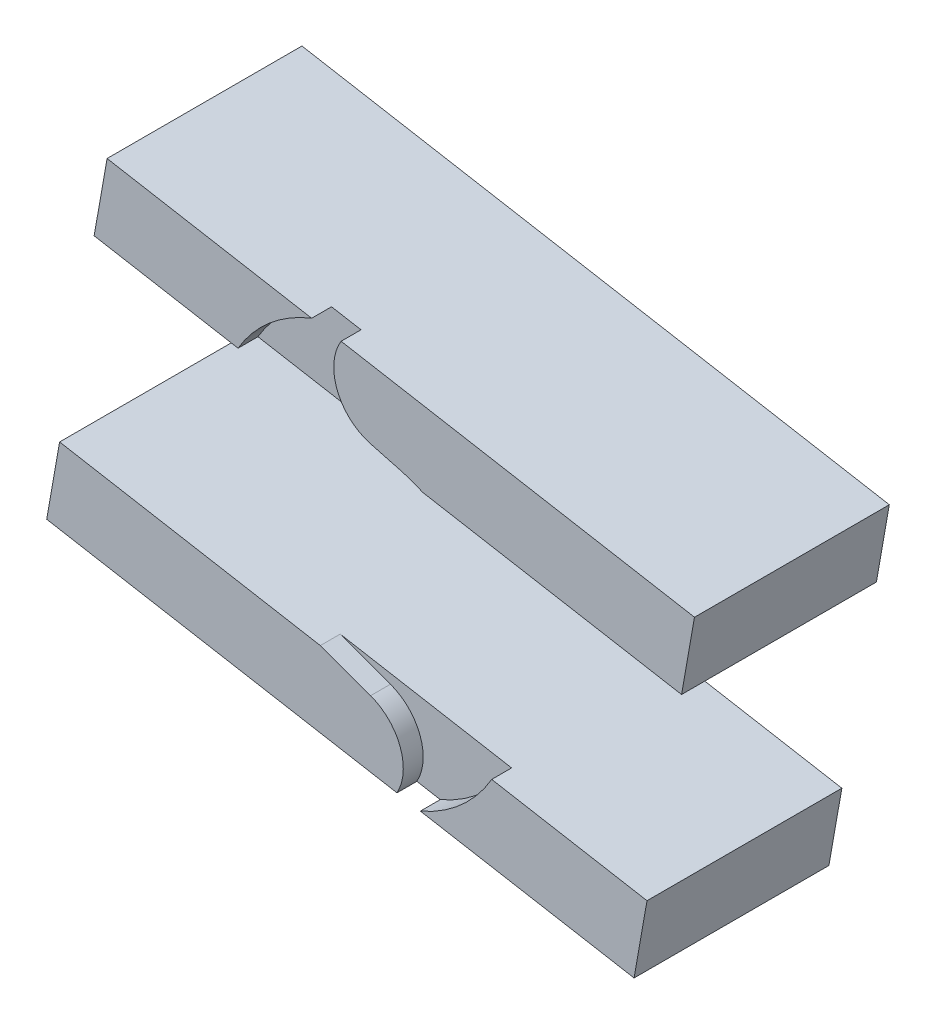
ISO-10303-21;
HEADER;
FILE_DESCRIPTION(('STEP AP214'),'2;1');
FILE_NAME('part.step','',(''),(''),'','','');
FILE_SCHEMA(('AUTOMOTIVE_DESIGN { 1 0 10303 214 1 1 1 1 }'));
ENDSEC;
DATA;
#1=APPLICATION_CONTEXT('core data for automotive mechanical design processes');
#2=APPLICATION_PROTOCOL_DEFINITION('international standard','automotive_design',2000,#1);
#3=PRODUCT_CONTEXT('',#1,'mechanical');
#4=PRODUCT('Part','Part','',(#3));
#5=PRODUCT_RELATED_PRODUCT_CATEGORY('part','',(#4));
#6=PRODUCT_DEFINITION_FORMATION('','',#4);
#7=PRODUCT_DEFINITION_CONTEXT('part definition',#1,'design');
#8=PRODUCT_DEFINITION('design','',#6,#7);
#9=PRODUCT_DEFINITION_SHAPE('','',#8);
#10=(LENGTH_UNIT() NAMED_UNIT(*) SI_UNIT(.MILLI.,.METRE.));
#11=(NAMED_UNIT(*) PLANE_ANGLE_UNIT() SI_UNIT($,.RADIAN.));
#12=(NAMED_UNIT(*) SI_UNIT($,.STERADIAN.) SOLID_ANGLE_UNIT());
#13=UNCERTAINTY_MEASURE_WITH_UNIT(LENGTH_MEASURE(1.E-05),#10,'distance_accuracy_value','');
#14=(GEOMETRIC_REPRESENTATION_CONTEXT(3) GLOBAL_UNCERTAINTY_ASSIGNED_CONTEXT((#13)) GLOBAL_UNIT_ASSIGNED_CONTEXT((#10,
#11,#12)) REPRESENTATION_CONTEXT('',''));
#15=CARTESIAN_POINT('',(0.,0.,0.));
#16=DIRECTION('',(0.,0.,1.));
#17=DIRECTION('',(1.,0.,0.));
#18=AXIS2_PLACEMENT_3D('',#15,#16,#17);
#19=CARTESIAN_POINT('',(-4.34365582023604,-40.135903716019,3.048));
#20=DIRECTION('',(0.,0.,-1.));
#21=DIRECTION('',(-1.,0.,0.));
#22=AXIS2_PLACEMENT_3D('',#19,#20,#21);
#23=CYLINDRICAL_SURFACE('',#22,12.7);
#24=CARTESIAN_POINT('',(-4.34365582023604,-40.135903716019,-3.048));
#25=DIRECTION('',(0.,0.,1.));
#26=DIRECTION('',(1.,0.,0.));
#27=AXIS2_PLACEMENT_3D('',#24,#25,#26);
#28=CIRCLE('',#27,12.7);
#29=CARTESIAN_POINT('',(6.74608058450968,-46.325228919404,-3.048));
#30=VERTEX_POINT('',#29);
#31=CARTESIAN_POINT('',(0.,-28.2018074320379,-3.048));
#32=VERTEX_POINT('',#31);
#33=EDGE_CURVE('E137',#30,#32,#28,.T.);
#34=ORIENTED_EDGE('',*,*,#33,.T.);
#35=DIRECTION('',(0.,0.,-1.));
#36=VECTOR('',#35,1.);
#37=CARTESIAN_POINT('',(0.,-28.2018074320379,3.048));
#38=LINE('',#37,#36);
#39=CARTESIAN_POINT('',(0.,-28.2018074320379,2.032));
#40=VERTEX_POINT('',#39);
#41=EDGE_CURVE('E123',#40,#32,#38,.T.);
#42=ORIENTED_EDGE('',*,*,#41,.F.);
#43=CARTESIAN_POINT('',(-4.34365582023604,-40.135903716019,2.032));
#44=DIRECTION('',(0.,0.,1.));
#45=DIRECTION('',(1.,0.,0.));
#46=AXIS2_PLACEMENT_3D('',#43,#44,#45);
#47=CIRCLE('',#46,12.7);
#48=CARTESIAN_POINT('',(6.74608058450968,-46.325228919404,2.032));
#49=VERTEX_POINT('',#48);
#50=EDGE_CURVE('E133',#40,#49,#47,.F.);
#51=ORIENTED_EDGE('',*,*,#50,.T.);
#52=DIRECTION('',(0.,0.,-1.));
#53=VECTOR('',#52,1.);
#54=CARTESIAN_POINT('',(6.74608058450968,-46.325228919404,3.048));
#55=LINE('',#54,#53);
#56=EDGE_CURVE('E138',#30,#49,#55,.F.);
#57=ORIENTED_EDGE('',*,*,#56,.F.);
#58=EDGE_LOOP('',(#34,#42,#51,#57));
#59=FACE_BOUND('',#58,.T.);
#60=ADVANCED_FACE('F47',(#59),#23,.T.);
#61=CARTESIAN_POINT('',(-9.06388619403997,-24.902822650631,3.048));
#62=DIRECTION('',(-0.342020143325673,-0.939692620785907,0.));
#63=DIRECTION('',(0.939692620785907,-0.342020143325673,0.));
#64=AXIS2_PLACEMENT_3D('',#61,#62,#63);
#65=PLANE('',#64);
#66=DIRECTION('',(0.939692620785907,-0.342020143325673,0.));
#67=VECTOR('',#66,1.);
#68=CARTESIAN_POINT('',(-9.06388619403997,-24.902822650631,2.032));
#69=LINE('',#68,#67);
#70=CARTESIAN_POINT('',(-12.8433687033597,-23.5272035163089,2.032));
#71=VERTEX_POINT('',#70);
#72=EDGE_CURVE('E130',#71,#40,#69,.T.);
#73=ORIENTED_EDGE('',*,*,#72,.T.);
#74=ORIENTED_EDGE('',*,*,#41,.T.);
#75=DIRECTION('',(-0.939692620785907,0.342020143325673,0.));
#76=VECTOR('',#75,1.);
#77=CARTESIAN_POINT('',(-9.06388619403997,-24.902822650631,-3.048));
#78=LINE('',#77,#76);
#79=CARTESIAN_POINT('',(-12.8433687033593,-23.527203516309,-3.048));
#80=VERTEX_POINT('',#79);
#81=EDGE_CURVE('E127',#32,#80,#78,.T.);
#82=ORIENTED_EDGE('',*,*,#81,.T.);
#83=DIRECTION('',(0.,0.,-1.));
#84=VECTOR('',#83,1.);
#85=CARTESIAN_POINT('',(-12.8433687033593,-23.527203516309,162.968548839141));
#86=LINE('',#85,#84);
#87=EDGE_CURVE('E160',#71,#80,#86,.T.);
#88=ORIENTED_EDGE('',*,*,#87,.F.);
#89=EDGE_LOOP('',(#73,#74,#82,#88));
#90=FACE_BOUND('',#89,.T.);
#91=ADVANCED_FACE('F125',(#90),#65,.F.);
#92=CARTESIAN_POINT('',(0.,0.,-3.048));
#93=DIRECTION('',(0.,0.,1.));
#94=DIRECTION('',(1.,0.,0.));
#95=AXIS2_PLACEMENT_3D('',#92,#93,#94);
#96=PLANE('',#95);
#97=DIRECTION('',(0.984807753012207,-0.173648177666934,0.));
#98=VECTOR('',#97,1.);
#99=CARTESIAN_POINT('',(-82.7610122768255,-30.5427134831723,-3.048));
#100=LINE('',#99,#98);
#101=CARTESIAN_POINT('',(12.7189421269623,-47.3784055613744,-3.048));
#102=VERTEX_POINT('',#101);
#103=EDGE_CURVE('E154',#30,#102,#100,.T.);
#104=ORIENTED_EDGE('',*,*,#103,.T.);
#105=CARTESIAN_POINT('',(-2.48342826754325,-11.827752618226,-3.048));
#106=DIRECTION('',(0.,0.,1.));
#107=DIRECTION('',(1.,0.,0.));
#108=AXIS2_PLACEMENT_3D('',#105,#106,#107);
#109=CIRCLE('',#108,38.6647254004982);
#110=CARTESIAN_POINT('',(30.9496738199748,-31.2490984804861,-3.048));
#111=VERTEX_POINT('',#110);
#112=EDGE_CURVE('E134',#102,#111,#109,.T.);
#113=ORIENTED_EDGE('',*,*,#112,.T.);
#114=DIRECTION('',(-0.984807753012207,0.173648177666934,0.));
#115=VECTOR('',#114,1.);
#116=CARTESIAN_POINT('',(-79.4530144922704,-11.7821257882897,-3.048));
#117=LINE('',#116,#115);
#118=EDGE_CURVE('E143',#111,#80,#117,.T.);
#119=ORIENTED_EDGE('',*,*,#118,.T.);
#120=ORIENTED_EDGE('',*,*,#81,.F.);
#121=ORIENTED_EDGE('',*,*,#33,.F.);
#122=EDGE_LOOP('',(#104,#113,#119,#120,#121));
#123=FACE_BOUND('',#122,.T.);
#124=ADVANCED_FACE('F49',(#123),#96,.T.);
#125=CARTESIAN_POINT('',(-2.48342826754325,-11.827752618226,3.048));
#126=DIRECTION('',(0.,0.,-1.));
#127=DIRECTION('',(-1.,0.,0.));
#128=AXIS2_PLACEMENT_3D('',#125,#126,#127);
#129=CYLINDRICAL_SURFACE('',#128,38.6647254004982);
#130=DIRECTION('',(0.,0.,-1.));
#131=VECTOR('',#130,1.);
#132=CARTESIAN_POINT('',(12.7189421269623,-47.3784055613744,3.048));
#133=LINE('',#132,#131);
#134=CARTESIAN_POINT('',(12.7189421269623,-47.3784055613744,2.032));
#135=VERTEX_POINT('',#134);
#136=EDGE_CURVE('E156',#102,#135,#133,.F.);
#137=ORIENTED_EDGE('',*,*,#136,.T.);
#138=CARTESIAN_POINT('',(-2.48342826754325,-11.827752618226,2.032));
#139=DIRECTION('',(0.,0.,1.));
#140=DIRECTION('',(1.,0.,0.));
#141=AXIS2_PLACEMENT_3D('',#138,#139,#140);
#142=CIRCLE('',#141,38.6647254004982);
#143=CARTESIAN_POINT('',(30.9496738199748,-31.2490984804861,2.032));
#144=VERTEX_POINT('',#143);
#145=EDGE_CURVE('E162',#144,#135,#142,.F.);
#146=ORIENTED_EDGE('',*,*,#145,.F.);
#147=DIRECTION('',(0.,0.,-1.));
#148=VECTOR('',#147,1.);
#149=CARTESIAN_POINT('',(30.9496738199748,-31.2490984804861,3.048));
#150=LINE('',#149,#148);
#151=EDGE_CURVE('E151',#144,#111,#150,.T.);
#152=ORIENTED_EDGE('',*,*,#151,.T.);
#153=ORIENTED_EDGE('',*,*,#112,.F.);
#154=EDGE_LOOP('',(#137,#146,#152,#153));
#155=FACE_BOUND('',#154,.T.);
#156=ADVANCED_FACE('F206',(#155),#129,.F.);
#157=CARTESIAN_POINT('',(-82.7610122768255,-30.5427134831723,162.968548839141));
#158=DIRECTION('',(0.173648177666934,0.984807753012207,0.));
#159=DIRECTION('',(-0.984807753012207,0.173648177666934,0.));
#160=AXIS2_PLACEMENT_3D('',#157,#158,#159);
#161=PLANE('',#160);
#162=ORIENTED_EDGE('',*,*,#136,.F.);
#163=ORIENTED_EDGE('',*,*,#103,.F.);
#164=ORIENTED_EDGE('',*,*,#56,.T.);
#165=DIRECTION('',(0.984807753012207,-0.173648177666934,0.));
#166=VECTOR('',#165,1.);
#167=CARTESIAN_POINT('',(-82.7610122768255,-30.5427134831723,2.03200000000001));
#168=LINE('',#167,#166);
#169=CARTESIAN_POINT('',(-82.7610122768255,-30.5427134831723,2.03200000000001));
#170=VERTEX_POINT('',#169);
#171=EDGE_CURVE('E164',#170,#49,#168,.T.);
#172=ORIENTED_EDGE('',*,*,#171,.F.);
#173=DIRECTION('',(0.,0.,-1.));
#174=VECTOR('',#173,1.);
#175=CARTESIAN_POINT('',(-82.7610122768255,-30.5427134831723,162.968548839141));
#176=LINE('',#175,#174);
#177=CARTESIAN_POINT('',(-82.7610122768255,-30.5427134831723,-47.752));
#178=VERTEX_POINT('',#177);
#179=EDGE_CURVE('E71',#170,#178,#176,.T.);
#180=ORIENTED_EDGE('',*,*,#179,.T.);
#181=DIRECTION('',(-0.984807753012207,0.173648177666934,0.));
#182=VECTOR('',#181,1.);
#183=CARTESIAN_POINT('',(-82.7610122768255,-30.5427134831723,-47.752));
#184=LINE('',#183,#182);
#185=CARTESIAN_POINT('',(67.323689282235,-57.006695759613,-47.752));
#186=VERTEX_POINT('',#185);
#187=EDGE_CURVE('E177',#186,#178,#184,.T.);
#188=ORIENTED_EDGE('',*,*,#187,.F.);
#189=DIRECTION('',(0.,0.,-1.));
#190=VECTOR('',#189,1.);
#191=CARTESIAN_POINT('',(67.323689282235,-57.006695759613,162.968548839141));
#192=LINE('',#191,#190);
#193=CARTESIAN_POINT('',(67.323689282235,-57.006695759613,2.03200000000001));
#194=VERTEX_POINT('',#193);
#195=EDGE_CURVE('E64',#194,#186,#192,.T.);
#196=ORIENTED_EDGE('',*,*,#195,.F.);
#197=EDGE_CURVE('E166',#135,#194,#168,.T.);
#198=ORIENTED_EDGE('',*,*,#197,.F.);
#199=EDGE_LOOP('',(#162,#163,#164,#172,#180,#188,#196,#198));
#200=FACE_BOUND('',#199,.T.);
#201=ADVANCED_FACE('F209',(#200),#161,.F.);
#202=CARTESIAN_POINT('',(-79.4530144922704,-11.7821257882897,162.968548839141));
#203=DIRECTION('',(-0.173648177666934,-0.984807753012207,0.));
#204=DIRECTION('',(0.984807753012207,-0.173648177666934,0.));
#205=AXIS2_PLACEMENT_3D('',#202,#203,#204);
#206=PLANE('',#205);
#207=ORIENTED_EDGE('',*,*,#151,.F.);
#208=DIRECTION('',(-0.984807753012207,0.173648177666934,0.));
#209=VECTOR('',#208,1.);
#210=CARTESIAN_POINT('',(-79.4530144922704,-11.7821257882897,2.03200000000001));
#211=LINE('',#210,#209);
#212=CARTESIAN_POINT('',(70.6316870667901,-38.2461080647305,2.03200000000001));
#213=VERTEX_POINT('',#212);
#214=EDGE_CURVE('E51',#213,#144,#211,.T.);
#215=ORIENTED_EDGE('',*,*,#214,.F.);
#216=DIRECTION('',(0.,0.,-1.));
#217=VECTOR('',#216,1.);
#218=CARTESIAN_POINT('',(70.6316870667901,-38.2461080647305,162.968548839141));
#219=LINE('',#218,#217);
#220=CARTESIAN_POINT('',(70.6316870667901,-38.2461080647305,-47.752));
#221=VERTEX_POINT('',#220);
#222=EDGE_CURVE('E190',#213,#221,#219,.T.);
#223=ORIENTED_EDGE('',*,*,#222,.T.);
#224=DIRECTION('',(0.984807753012207,-0.173648177666934,0.));
#225=VECTOR('',#224,1.);
#226=CARTESIAN_POINT('',(-79.4530144922704,-11.7821257882897,-47.752));
#227=LINE('',#226,#225);
#228=CARTESIAN_POINT('',(-79.4530144922704,-11.7821257882897,-47.752));
#229=VERTEX_POINT('',#228);
#230=EDGE_CURVE('E56',#229,#221,#227,.T.);
#231=ORIENTED_EDGE('',*,*,#230,.F.);
#232=DIRECTION('',(0.,0.,-1.));
#233=VECTOR('',#232,1.);
#234=CARTESIAN_POINT('',(-79.4530144922704,-11.7821257882897,162.968548839141));
#235=LINE('',#234,#233);
#236=CARTESIAN_POINT('',(-79.4530144922704,-11.7821257882897,2.03200000000001));
#237=VERTEX_POINT('',#236);
#238=EDGE_CURVE('E180',#237,#229,#235,.T.);
#239=ORIENTED_EDGE('',*,*,#238,.F.);
#240=EDGE_CURVE('E192',#71,#237,#211,.T.);
#241=ORIENTED_EDGE('',*,*,#240,.F.);
#242=ORIENTED_EDGE('',*,*,#87,.T.);
#243=ORIENTED_EDGE('',*,*,#118,.F.);
#244=EDGE_LOOP('',(#207,#215,#223,#231,#239,#241,#242,#243));
#245=FACE_BOUND('',#244,.T.);
#246=ADVANCED_FACE('F194',(#245),#206,.F.);
#247=CARTESIAN_POINT('',(0.,0.,2.032));
#248=DIRECTION('',(0.,0.,1.));
#249=DIRECTION('',(1.,0.,0.));
#250=AXIS2_PLACEMENT_3D('',#247,#248,#249);
#251=PLANE('',#250);
#252=ORIENTED_EDGE('',*,*,#72,.F.);
#253=ORIENTED_EDGE('',*,*,#240,.T.);
#254=DIRECTION('',(-0.173648177666933,-0.984807753012208,0.));
#255=VECTOR('',#254,1.);
#256=CARTESIAN_POINT('',(-79.4530144922704,-11.7821257882897,2.03200000000001));
#257=LINE('',#256,#255);
#258=EDGE_CURVE('E169',#237,#170,#257,.T.);
#259=ORIENTED_EDGE('',*,*,#258,.T.);
#260=ORIENTED_EDGE('',*,*,#171,.T.);
#261=ORIENTED_EDGE('',*,*,#50,.F.);
#262=EDGE_LOOP('',(#252,#253,#259,#260,#261));
#263=FACE_BOUND('',#262,.T.);
#264=ADVANCED_FACE('F197',(#263),#251,.T.);
#265=CARTESIAN_POINT('',(-79.4530144922704,-11.7821257882897,162.968548839141));
#266=DIRECTION('',(0.984807753012208,-0.173648177666933,0.));
#267=DIRECTION('',(0.173648177666933,0.984807753012208,0.));
#268=AXIS2_PLACEMENT_3D('',#265,#266,#267);
#269=PLANE('',#268);
#270=ORIENTED_EDGE('',*,*,#258,.F.);
#271=ORIENTED_EDGE('',*,*,#238,.T.);
#272=DIRECTION('',(0.173648177666933,0.984807753012208,0.));
#273=VECTOR('',#272,1.);
#274=CARTESIAN_POINT('',(-79.4530144922704,-11.7821257882897,-47.752));
#275=LINE('',#274,#273);
#276=EDGE_CURVE('E179',#178,#229,#275,.T.);
#277=ORIENTED_EDGE('',*,*,#276,.F.);
#278=ORIENTED_EDGE('',*,*,#179,.F.);
#279=EDGE_LOOP('',(#270,#271,#277,#278));
#280=FACE_BOUND('',#279,.T.);
#281=ADVANCED_FACE('F200',(#280),#269,.F.);
#282=CARTESIAN_POINT('',(70.6316870667901,-38.2461080647305,162.968548839141));
#283=DIRECTION('',(-0.984807753012207,0.173648177666936,0.));
#284=DIRECTION('',(-0.173648177666936,-0.984807753012207,0.));
#285=AXIS2_PLACEMENT_3D('',#282,#283,#284);
#286=PLANE('',#285);
#287=DIRECTION('',(0.173648177666936,0.984807753012207,0.));
#288=VECTOR('',#287,1.);
#289=CARTESIAN_POINT('',(70.6316870667901,-38.2461080647305,2.03200000000001));
#290=LINE('',#289,#288);
#291=EDGE_CURVE('E163',#194,#213,#290,.T.);
#292=ORIENTED_EDGE('',*,*,#291,.F.);
#293=ORIENTED_EDGE('',*,*,#195,.T.);
#294=DIRECTION('',(-0.173648177666936,-0.984807753012207,0.));
#295=VECTOR('',#294,1.);
#296=CARTESIAN_POINT('',(70.6316870667901,-38.2461080647305,-47.752));
#297=LINE('',#296,#295);
#298=EDGE_CURVE('E12',#221,#186,#297,.T.);
#299=ORIENTED_EDGE('',*,*,#298,.F.);
#300=ORIENTED_EDGE('',*,*,#222,.F.);
#301=EDGE_LOOP('',(#292,#293,#299,#300));
#302=FACE_BOUND('',#301,.T.);
#303=ADVANCED_FACE('F189',(#302),#286,.F.);
#304=ORIENTED_EDGE('',*,*,#214,.T.);
#305=ORIENTED_EDGE('',*,*,#145,.T.);
#306=ORIENTED_EDGE('',*,*,#197,.T.);
#307=ORIENTED_EDGE('',*,*,#291,.T.);
#308=EDGE_LOOP('',(#304,#305,#306,#307));
#309=FACE_BOUND('',#308,.T.);
#310=ADVANCED_FACE('F208',(#309),#251,.T.);
#311=CARTESIAN_POINT('',(0.,0.,-47.752));
#312=DIRECTION('',(0.,0.,1.));
#313=DIRECTION('',(1.,0.,0.));
#314=AXIS2_PLACEMENT_3D('',#311,#312,#313);
#315=PLANE('',#314);
#316=ORIENTED_EDGE('',*,*,#276,.T.);
#317=ORIENTED_EDGE('',*,*,#230,.T.);
#318=ORIENTED_EDGE('',*,*,#298,.T.);
#319=ORIENTED_EDGE('',*,*,#187,.T.);
#320=EDGE_LOOP('',(#316,#317,#318,#319));
#321=FACE_BOUND('',#320,.T.);
#322=ADVANCED_FACE('F185',(#321),#315,.F.);
#323=CLOSED_SHELL('',(#60,#91,#124,#156,#201,#246,#264,#281,#303,#310,#322));
#324=MANIFOLD_SOLID_BREP('B2',#323);
#325=CARTESIAN_POINT('',(0.,0.,-3.048));
#326=DIRECTION('',(0.,0.,1.));
#327=DIRECTION('',(1.,0.,0.));
#328=AXIS2_PLACEMENT_3D('',#325,#326,#327);
#329=PLANE('',#328);
#330=CARTESIAN_POINT('',(-2.48342826754325,-11.827752618226,-3.048));
#331=DIRECTION('',(0.,0.,1.));
#332=DIRECTION('',(1.,0.,0.));
#333=AXIS2_PLACEMENT_3D('',#330,#331,#332);
#334=CIRCLE('',#333,38.6647254004982);
#335=CARTESIAN_POINT('',(13.3811149594307,23.4323843425886,-3.048));
#336=VERTEX_POINT('',#335);
#337=CARTESIAN_POINT('',(7.52373903976478,25.5195042124902,-3.048));
#338=VERTEX_POINT('',#337);
#339=EDGE_CURVE('E474',#336,#338,#334,.T.);
#340=ORIENTED_EDGE('',*,*,#339,.T.);
#341=DIRECTION('',(0.965925826289069,-0.258819045102518,0.));
#342=VECTOR('',#341,1.);
#343=CARTESIAN_POINT('',(6.88387100306433,25.6909563361866,-3.048));
#344=LINE('',#343,#342);
#345=CARTESIAN_POINT('',(0.,27.5354840122576,-3.048));
#346=VERTEX_POINT('',#345);
#347=EDGE_CURVE('E472',#346,#338,#344,.T.);
#348=ORIENTED_EDGE('',*,*,#347,.F.);
#349=CARTESIAN_POINT('',(3.28700187280198,39.8027420061288,-3.048));
#350=DIRECTION('',(0.,0.,1.));
#351=DIRECTION('',(1.,0.,0.));
#352=AXIS2_PLACEMENT_3D('',#349,#350,#351);
#353=CIRCLE('',#352,12.7);
#354=CARTESIAN_POINT('',(-7.52655420820017,46.462847476992,-3.048));
#355=VERTEX_POINT('',#354);
#356=EDGE_CURVE('E469',#355,#346,#353,.T.);
#357=ORIENTED_EDGE('',*,*,#356,.F.);
#358=DIRECTION('',(0.984807753012207,-0.173648177666934,0.));
#359=VECTOR('',#358,1.);
#360=CARTESIAN_POINT('',(7.71866149729522,43.7747046213926,-3.048));
#361=LINE('',#360,#359);
#362=CARTESIAN_POINT('',(-15.0577360385898,47.7907980303111,-3.048));
#363=VERTEX_POINT('',#362);
#364=EDGE_CURVE('E444',#363,#355,#361,.T.);
#365=ORIENTED_EDGE('',*,*,#364,.F.);
#366=CARTESIAN_POINT('',(-1.24139416120389,12.5408173038956,-3.048));
#367=DIRECTION('',(0.,0.,1.));
#368=DIRECTION('',(1.,0.,0.));
#369=AXIS2_PLACEMENT_3D('',#366,#367,#368);
#370=CIRCLE('',#369,37.8609620068675);
#371=CARTESIAN_POINT('',(-33.8602061938296,31.7623038662221,-3.048));
#372=VERTEX_POINT('',#371);
#373=EDGE_CURVE('E302',#363,#372,#370,.T.);
#374=ORIENTED_EDGE('',*,*,#373,.T.);
#375=DIRECTION('',(-0.984807753012207,0.173648177666934,0.));
#376=VECTOR('',#375,1.);
#377=CARTESIAN_POINT('',(4.41066371274012,25.0141169265101,-3.048));
#378=LINE('',#377,#376);
#379=EDGE_CURVE('E449',#336,#372,#378,.T.);
#380=ORIENTED_EDGE('',*,*,#379,.F.);
#381=EDGE_LOOP('',(#340,#348,#357,#365,#374,#380));
#382=FACE_BOUND('',#381,.T.);
#383=ADVANCED_FACE('F298',(#382),#329,.T.);
#384=CARTESIAN_POINT('',(-2.48342826754325,-11.827752618226,3.048));
#385=DIRECTION('',(0.,0.,-1.));
#386=DIRECTION('',(-1.,0.,0.));
#387=AXIS2_PLACEMENT_3D('',#384,#385,#386);
#388=CYLINDRICAL_SURFACE('',#387,38.6647254004982);
#389=CARTESIAN_POINT('',(-2.48342826754325,-11.827752618226,2.032));
#390=DIRECTION('',(0.,0.,1.));
#391=DIRECTION('',(1.,0.,0.));
#392=AXIS2_PLACEMENT_3D('',#389,#390,#391);
#393=CIRCLE('',#392,38.6647254004982);
#394=CARTESIAN_POINT('',(13.3811149594308,23.4323843425886,2.032));
#395=VERTEX_POINT('',#394);
#396=CARTESIAN_POINT('',(7.52373903976478,25.5195042124902,2.032));
#397=VERTEX_POINT('',#396);
#398=EDGE_CURVE('E459',#395,#397,#393,.T.);
#399=ORIENTED_EDGE('',*,*,#398,.T.);
#400=DIRECTION('',(0.,0.,-1.));
#401=VECTOR('',#400,1.);
#402=CARTESIAN_POINT('',(7.52373903976478,25.5195042124902,3.048));
#403=LINE('',#402,#401);
#404=EDGE_CURVE('E463',#397,#338,#403,.T.);
#405=ORIENTED_EDGE('',*,*,#404,.T.);
#406=ORIENTED_EDGE('',*,*,#339,.F.);
#407=DIRECTION('',(0.,0.,-1.));
#408=VECTOR('',#407,1.);
#409=CARTESIAN_POINT('',(13.3811149594308,23.4323843425886,3.048));
#410=LINE('',#409,#408);
#411=EDGE_CURVE('E335',#395,#336,#410,.T.);
#412=ORIENTED_EDGE('',*,*,#411,.F.);
#413=EDGE_LOOP('',(#399,#405,#406,#412));
#414=FACE_BOUND('',#413,.T.);
#415=ADVANCED_FACE('F401',(#414),#388,.F.);
#416=CARTESIAN_POINT('',(-1.24139416120389,12.5408173038956,3.048));
#417=DIRECTION('',(0.,0.,-1.));
#418=DIRECTION('',(-1.,0.,0.));
#419=AXIS2_PLACEMENT_3D('',#416,#417,#418);
#420=CYLINDRICAL_SURFACE('',#419,37.8609620068675);
#421=ORIENTED_EDGE('',*,*,#373,.F.);
#422=DIRECTION('',(0.,0.,-1.));
#423=VECTOR('',#422,1.);
#424=CARTESIAN_POINT('',(-15.0577360385898,47.7907980303111,3.048));
#425=LINE('',#424,#423);
#426=CARTESIAN_POINT('',(-15.0577360385898,47.7907980303111,2.032));
#427=VERTEX_POINT('',#426);
#428=EDGE_CURVE('E491',#427,#363,#425,.T.);
#429=ORIENTED_EDGE('',*,*,#428,.F.);
#430=CARTESIAN_POINT('',(-1.24139416120389,12.5408173038956,2.032));
#431=DIRECTION('',(0.,0.,1.));
#432=DIRECTION('',(1.,0.,0.));
#433=AXIS2_PLACEMENT_3D('',#430,#431,#432);
#434=CIRCLE('',#433,37.8609620068675);
#435=CARTESIAN_POINT('',(-33.8602061938296,31.7623038662221,2.032));
#436=VERTEX_POINT('',#435);
#437=EDGE_CURVE('E455',#427,#436,#434,.T.);
#438=ORIENTED_EDGE('',*,*,#437,.T.);
#439=DIRECTION('',(0.,0.,-1.));
#440=VECTOR('',#439,1.);
#441=CARTESIAN_POINT('',(-33.8602061938296,31.7623038662221,3.048));
#442=LINE('',#441,#440);
#443=EDGE_CURVE('E458',#372,#436,#442,.F.);
#444=ORIENTED_EDGE('',*,*,#443,.F.);
#445=EDGE_LOOP('',(#421,#429,#438,#444));
#446=FACE_BOUND('',#445,.T.);
#447=ADVANCED_FACE('F407',(#446),#420,.F.);
#448=CARTESIAN_POINT('',(3.28700187280198,39.8027420061288,3.048));
#449=DIRECTION('',(0.,0.,-1.));
#450=DIRECTION('',(-1.,0.,0.));
#451=AXIS2_PLACEMENT_3D('',#448,#449,#450);
#452=CYLINDRICAL_SURFACE('',#451,12.7);
#453=DIRECTION('',(0.,0.,-1.));
#454=VECTOR('',#453,1.);
#455=CARTESIAN_POINT('',(-7.52655420820017,46.462847476992,3.048));
#456=LINE('',#455,#454);
#457=CARTESIAN_POINT('',(-7.52655420820017,46.462847476992,2.032));
#458=VERTEX_POINT('',#457);
#459=EDGE_CURVE('E461',#458,#355,#456,.T.);
#460=ORIENTED_EDGE('',*,*,#459,.T.);
#461=ORIENTED_EDGE('',*,*,#356,.T.);
#462=DIRECTION('',(0.,0.,-1.));
#463=VECTOR('',#462,1.);
#464=CARTESIAN_POINT('',(0.,27.5354840122576,3.048));
#465=LINE('',#464,#463);
#466=CARTESIAN_POINT('',(0.,27.5354840122576,2.032));
#467=VERTEX_POINT('',#466);
#468=EDGE_CURVE('E466',#467,#346,#465,.T.);
#469=ORIENTED_EDGE('',*,*,#468,.F.);
#470=CARTESIAN_POINT('',(3.28700187280198,39.8027420061288,2.032));
#471=DIRECTION('',(0.,0.,1.));
#472=DIRECTION('',(1.,0.,0.));
#473=AXIS2_PLACEMENT_3D('',#470,#471,#472);
#474=CIRCLE('',#473,12.7);
#475=EDGE_CURVE('E343',#458,#467,#474,.T.);
#476=ORIENTED_EDGE('',*,*,#475,.F.);
#477=EDGE_LOOP('',(#460,#461,#469,#476));
#478=FACE_BOUND('',#477,.T.);
#479=ADVANCED_FACE('F411',(#478),#452,.T.);
#480=CARTESIAN_POINT('',(6.88387100306433,25.6909563361866,3.048));
#481=DIRECTION('',(0.258819045102518,0.965925826289069,0.));
#482=DIRECTION('',(-0.965925826289069,0.258819045102518,0.));
#483=AXIS2_PLACEMENT_3D('',#480,#481,#482);
#484=PLANE('',#483);
#485=ORIENTED_EDGE('',*,*,#468,.T.);
#486=ORIENTED_EDGE('',*,*,#347,.T.);
#487=ORIENTED_EDGE('',*,*,#404,.F.);
#488=DIRECTION('',(0.965925826289069,-0.258819045102518,0.));
#489=VECTOR('',#488,1.);
#490=CARTESIAN_POINT('',(6.88387100306433,25.6909563361866,2.032));
#491=LINE('',#490,#489);
#492=EDGE_CURVE('E450',#467,#397,#491,.T.);
#493=ORIENTED_EDGE('',*,*,#492,.F.);
#494=EDGE_LOOP('',(#485,#486,#487,#493));
#495=FACE_BOUND('',#494,.T.);
#496=ADVANCED_FACE('F414',(#495),#484,.F.);
#497=CARTESIAN_POINT('',(-70.6316870667901,38.2461080647304,162.968548839141));
#498=DIRECTION('',(0.984807753012207,-0.173648177666934,0.));
#499=DIRECTION('',(0.173648177666934,0.984807753012207,0.));
#500=AXIS2_PLACEMENT_3D('',#497,#498,#499);
#501=PLANE('',#500);
#502=DIRECTION('',(-0.173648177666934,-0.984807753012207,0.));
#503=VECTOR('',#502,1.);
#504=CARTESIAN_POINT('',(-70.6316870667901,38.2461080647304,2.03200000000001));
#505=LINE('',#504,#503);
#506=CARTESIAN_POINT('',(-67.323689282235,57.006695759613,2.03200000000001));
#507=VERTEX_POINT('',#506);
#508=CARTESIAN_POINT('',(-70.6316870667901,38.2461080647304,2.03200000000001));
#509=VERTEX_POINT('',#508);
#510=EDGE_CURVE('E432',#507,#509,#505,.T.);
#511=ORIENTED_EDGE('',*,*,#510,.F.);
#512=DIRECTION('',(0.,0.,-1.));
#513=VECTOR('',#512,1.);
#514=CARTESIAN_POINT('',(-67.323689282235,57.006695759613,162.968548839141));
#515=LINE('',#514,#513);
#516=CARTESIAN_POINT('',(-67.323689282235,57.006695759613,-47.752));
#517=VERTEX_POINT('',#516);
#518=EDGE_CURVE('E433',#507,#517,#515,.T.);
#519=ORIENTED_EDGE('',*,*,#518,.T.);
#520=DIRECTION('',(0.173648177666934,0.984807753012207,0.));
#521=VECTOR('',#520,1.);
#522=CARTESIAN_POINT('',(-70.6316870667901,38.2461080647304,-47.752));
#523=LINE('',#522,#521);
#524=CARTESIAN_POINT('',(-70.6316870667901,38.2461080647304,-47.752));
#525=VERTEX_POINT('',#524);
#526=EDGE_CURVE('E383',#525,#517,#523,.T.);
#527=ORIENTED_EDGE('',*,*,#526,.F.);
#528=DIRECTION('',(0.,0.,-1.));
#529=VECTOR('',#528,1.);
#530=CARTESIAN_POINT('',(-70.6316870667901,38.2461080647304,162.968548839141));
#531=LINE('',#530,#529);
#532=EDGE_CURVE('E434',#509,#525,#531,.T.);
#533=ORIENTED_EDGE('',*,*,#532,.F.);
#534=EDGE_LOOP('',(#511,#519,#527,#533));
#535=FACE_BOUND('',#534,.T.);
#536=ADVANCED_FACE('F397',(#535),#501,.F.);
#537=CARTESIAN_POINT('',(0.,0.,-47.752));
#538=DIRECTION('',(0.,0.,1.));
#539=DIRECTION('',(1.,0.,0.));
#540=AXIS2_PLACEMENT_3D('',#537,#538,#539);
#541=PLANE('',#540);
#542=ORIENTED_EDGE('',*,*,#526,.T.);
#543=DIRECTION('',(0.984807753012207,-0.173648177666934,0.));
#544=VECTOR('',#543,1.);
#545=CARTESIAN_POINT('',(-67.323689282235,57.006695759613,-47.752));
#546=LINE('',#545,#544);
#547=CARTESIAN_POINT('',(82.7610122768254,30.5427134831723,-47.752));
#548=VERTEX_POINT('',#547);
#549=EDGE_CURVE('E308',#517,#548,#546,.T.);
#550=ORIENTED_EDGE('',*,*,#549,.T.);
#551=DIRECTION('',(-0.173648177666933,-0.984807753012208,0.));
#552=VECTOR('',#551,1.);
#553=CARTESIAN_POINT('',(79.4530144922704,11.7821257882897,-47.752));
#554=LINE('',#553,#552);
#555=CARTESIAN_POINT('',(79.4530144922704,11.7821257882897,-47.752));
#556=VERTEX_POINT('',#555);
#557=EDGE_CURVE('E45',#548,#556,#554,.T.);
#558=ORIENTED_EDGE('',*,*,#557,.T.);
#559=DIRECTION('',(-0.984807753012207,0.173648177666934,0.));
#560=VECTOR('',#559,1.);
#561=CARTESIAN_POINT('',(-70.6316870667901,38.2461080647304,-47.752));
#562=LINE('',#561,#560);
#563=EDGE_CURVE('E445',#556,#525,#562,.T.);
#564=ORIENTED_EDGE('',*,*,#563,.T.);
#565=EDGE_LOOP('',(#542,#550,#558,#564));
#566=FACE_BOUND('',#565,.T.);
#567=ADVANCED_FACE('F379',(#566),#541,.F.);
#568=CARTESIAN_POINT('',(79.4530144922704,11.7821257882897,162.968548839141));
#569=DIRECTION('',(-0.984807753012208,0.173648177666933,0.));
#570=DIRECTION('',(-0.173648177666933,-0.984807753012208,0.));
#571=AXIS2_PLACEMENT_3D('',#568,#569,#570);
#572=PLANE('',#571);
#573=DIRECTION('',(0.173648177666933,0.984807753012208,0.));
#574=VECTOR('',#573,1.);
#575=CARTESIAN_POINT('',(79.4530144922704,11.7821257882897,2.03200000000001));
#576=LINE('',#575,#574);
#577=CARTESIAN_POINT('',(79.4530144922704,11.7821257882897,2.03200000000001));
#578=VERTEX_POINT('',#577);
#579=CARTESIAN_POINT('',(82.7610122768254,30.5427134831723,2.03200000000001));
#580=VERTEX_POINT('',#579);
#581=EDGE_CURVE('E386',#578,#580,#576,.T.);
#582=ORIENTED_EDGE('',*,*,#581,.F.);
#583=DIRECTION('',(0.,0.,-1.));
#584=VECTOR('',#583,1.);
#585=CARTESIAN_POINT('',(79.4530144922704,11.7821257882897,162.968548839141));
#586=LINE('',#585,#584);
#587=EDGE_CURVE('E317',#578,#556,#586,.T.);
#588=ORIENTED_EDGE('',*,*,#587,.T.);
#589=ORIENTED_EDGE('',*,*,#557,.F.);
#590=DIRECTION('',(0.,0.,-1.));
#591=VECTOR('',#590,1.);
#592=CARTESIAN_POINT('',(82.7610122768254,30.5427134831723,162.968548839141));
#593=LINE('',#592,#591);
#594=EDGE_CURVE('E370',#580,#548,#593,.T.);
#595=ORIENTED_EDGE('',*,*,#594,.F.);
#596=EDGE_LOOP('',(#582,#588,#589,#595));
#597=FACE_BOUND('',#596,.T.);
#598=ADVANCED_FACE('F385',(#597),#572,.F.);
#599=CARTESIAN_POINT('',(0.,0.,2.032));
#600=DIRECTION('',(0.,0.,1.));
#601=DIRECTION('',(1.,0.,0.));
#602=AXIS2_PLACEMENT_3D('',#599,#600,#601);
#603=PLANE('',#602);
#604=ORIENTED_EDGE('',*,*,#398,.F.);
#605=DIRECTION('',(0.984807753012207,-0.173648177666934,0.));
#606=VECTOR('',#605,1.);
#607=CARTESIAN_POINT('',(-70.6316870667901,38.2461080647304,2.03200000000001));
#608=LINE('',#607,#606);
#609=EDGE_CURVE('E436',#395,#578,#608,.T.);
#610=ORIENTED_EDGE('',*,*,#609,.T.);
#611=ORIENTED_EDGE('',*,*,#581,.T.);
#612=DIRECTION('',(-0.984807753012207,0.173648177666934,0.));
#613=VECTOR('',#612,1.);
#614=CARTESIAN_POINT('',(-67.323689282235,57.006695759613,2.03200000000001));
#615=LINE('',#614,#613);
#616=EDGE_CURVE('E374',#580,#458,#615,.T.);
#617=ORIENTED_EDGE('',*,*,#616,.T.);
#618=ORIENTED_EDGE('',*,*,#475,.T.);
#619=ORIENTED_EDGE('',*,*,#492,.T.);
#620=EDGE_LOOP('',(#604,#610,#611,#617,#618,#619));
#621=FACE_BOUND('',#620,.T.);
#622=ADVANCED_FACE('F388',(#621),#603,.T.);
#623=ORIENTED_EDGE('',*,*,#437,.F.);
#624=EDGE_CURVE('E351',#427,#507,#615,.T.);
#625=ORIENTED_EDGE('',*,*,#624,.T.);
#626=ORIENTED_EDGE('',*,*,#510,.T.);
#627=EDGE_CURVE('E439',#509,#436,#608,.T.);
#628=ORIENTED_EDGE('',*,*,#627,.T.);
#629=EDGE_LOOP('',(#623,#625,#626,#628));
#630=FACE_BOUND('',#629,.T.);
#631=ADVANCED_FACE('F394',(#630),#603,.T.);
#632=CARTESIAN_POINT('',(-67.323689282235,57.006695759613,162.968548839141));
#633=DIRECTION('',(-0.173648177666934,-0.984807753012207,0.));
#634=DIRECTION('',(0.984807753012207,-0.173648177666934,0.));
#635=AXIS2_PLACEMENT_3D('',#632,#633,#634);
#636=PLANE('',#635);
#637=ORIENTED_EDGE('',*,*,#624,.F.);
#638=ORIENTED_EDGE('',*,*,#428,.T.);
#639=ORIENTED_EDGE('',*,*,#364,.T.);
#640=ORIENTED_EDGE('',*,*,#459,.F.);
#641=ORIENTED_EDGE('',*,*,#616,.F.);
#642=ORIENTED_EDGE('',*,*,#594,.T.);
#643=ORIENTED_EDGE('',*,*,#549,.F.);
#644=ORIENTED_EDGE('',*,*,#518,.F.);
#645=EDGE_LOOP('',(#637,#638,#639,#640,#641,#642,#643,#644));
#646=FACE_BOUND('',#645,.T.);
#647=ADVANCED_FACE('F372',(#646),#636,.F.);
#648=CARTESIAN_POINT('',(-70.6316870667901,38.2461080647304,162.968548839141));
#649=DIRECTION('',(0.173648177666934,0.984807753012207,0.));
#650=DIRECTION('',(-0.984807753012207,0.173648177666934,0.));
#651=AXIS2_PLACEMENT_3D('',#648,#649,#650);
#652=PLANE('',#651);
#653=ORIENTED_EDGE('',*,*,#379,.T.);
#654=ORIENTED_EDGE('',*,*,#443,.T.);
#655=ORIENTED_EDGE('',*,*,#627,.F.);
#656=ORIENTED_EDGE('',*,*,#532,.T.);
#657=ORIENTED_EDGE('',*,*,#563,.F.);
#658=ORIENTED_EDGE('',*,*,#587,.F.);
#659=ORIENTED_EDGE('',*,*,#609,.F.);
#660=ORIENTED_EDGE('',*,*,#411,.T.);
#661=EDGE_LOOP('',(#653,#654,#655,#656,#657,#658,#659,#660));
#662=FACE_BOUND('',#661,.T.);
#663=ADVANCED_FACE('F300',(#662),#652,.F.);
#664=CLOSED_SHELL('',(#383,#415,#447,#479,#496,#536,#567,#598,#622,#631,#647,#663));
#665=MANIFOLD_SOLID_BREP('B6',#664);
#666=ADVANCED_BREP_SHAPE_REPRESENTATION('',(#18,#324,#665),#14);
#667=SHAPE_DEFINITION_REPRESENTATION(#9,#666);
ENDSEC;
END-ISO-10303-21;
